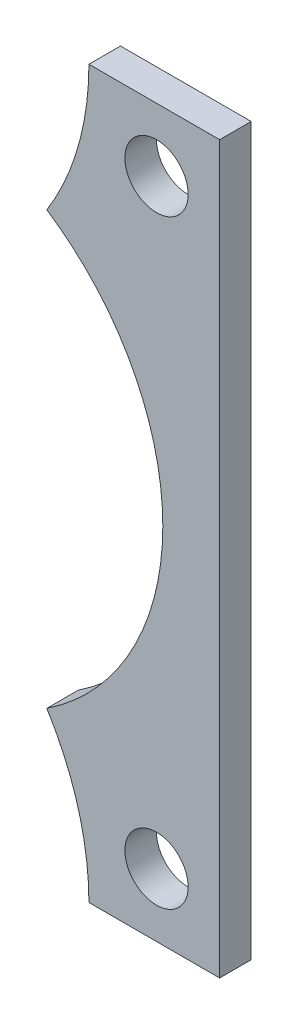
ISO-10303-21;
HEADER;
FILE_DESCRIPTION(('STEP AP214'),'2;1');
FILE_NAME('part.step','',(''),(''),'','','');
FILE_SCHEMA(('AUTOMOTIVE_DESIGN { 1 0 10303 214 1 1 1 1 }'));
ENDSEC;
DATA;
#1=APPLICATION_CONTEXT('core data for automotive mechanical design processes');
#2=APPLICATION_PROTOCOL_DEFINITION('international standard','automotive_design',2000,#1);
#3=PRODUCT_CONTEXT('',#1,'mechanical');
#4=PRODUCT('Part','Part','',(#3));
#5=PRODUCT_RELATED_PRODUCT_CATEGORY('part','',(#4));
#6=PRODUCT_DEFINITION_FORMATION('','',#4);
#7=PRODUCT_DEFINITION_CONTEXT('part definition',#1,'design');
#8=PRODUCT_DEFINITION('design','',#6,#7);
#9=PRODUCT_DEFINITION_SHAPE('','',#8);
#10=(LENGTH_UNIT() NAMED_UNIT(*) SI_UNIT(.MILLI.,.METRE.));
#11=(NAMED_UNIT(*) PLANE_ANGLE_UNIT() SI_UNIT($,.RADIAN.));
#12=(NAMED_UNIT(*) SI_UNIT($,.STERADIAN.) SOLID_ANGLE_UNIT());
#13=UNCERTAINTY_MEASURE_WITH_UNIT(LENGTH_MEASURE(1.E-05),#10,'distance_accuracy_value','');
#14=(GEOMETRIC_REPRESENTATION_CONTEXT(3) GLOBAL_UNCERTAINTY_ASSIGNED_CONTEXT((#13)) GLOBAL_UNIT_ASSIGNED_CONTEXT((#10,
#11,#12)) REPRESENTATION_CONTEXT('',''));
#15=CARTESIAN_POINT('',(0.,0.,0.));
#16=DIRECTION('',(0.,0.,1.));
#17=DIRECTION('',(1.,0.,0.));
#18=AXIS2_PLACEMENT_3D('',#15,#16,#17);
#19=CARTESIAN_POINT('',(-63.1804076074481,-73.025,3.175));
#20=DIRECTION('',(0.,0.,-1.));
#21=DIRECTION('',(-1.,0.,0.));
#22=AXIS2_PLACEMENT_3D('',#19,#20,#21);
#23=CYLINDRICAL_SURFACE('',#22,55.9342935428807);
#24=CARTESIAN_POINT('',(-63.1804076074481,-73.025,-3.175));
#25=DIRECTION('',(0.,0.,1.));
#26=DIRECTION('',(1.,0.,0.));
#27=AXIS2_PLACEMENT_3D('',#24,#25,#26);
#28=CIRCLE('',#27,55.9342935428807);
#29=CARTESIAN_POINT('',(-7.24611406456736,-73.025,-3.175));
#30=VERTEX_POINT('',#29);
#31=CARTESIAN_POINT('',(-15.7193193483994,-43.4261774658528,-3.175));
#32=VERTEX_POINT('',#31);
#33=EDGE_CURVE('E126',#30,#32,#28,.T.);
#34=ORIENTED_EDGE('',*,*,#33,.F.);
#35=DIRECTION('',(0.,0.,-1.));
#36=VECTOR('',#35,1.);
#37=CARTESIAN_POINT('',(-7.24611406456736,-73.025,3.175));
#38=LINE('',#37,#36);
#39=CARTESIAN_POINT('',(-7.24611406456736,-73.025,3.175));
#40=VERTEX_POINT('',#39);
#41=EDGE_CURVE('E11',#40,#30,#38,.T.);
#42=ORIENTED_EDGE('',*,*,#41,.F.);
#43=CARTESIAN_POINT('',(-63.1804076074481,-73.025,3.175));
#44=DIRECTION('',(0.,0.,1.));
#45=DIRECTION('',(1.,0.,0.));
#46=AXIS2_PLACEMENT_3D('',#43,#44,#45);
#47=CIRCLE('',#46,55.9342935428807);
#48=CARTESIAN_POINT('',(-15.7193193483994,-43.4261774658528,3.175));
#49=VERTEX_POINT('',#48);
#50=EDGE_CURVE('E145',#40,#49,#47,.T.);
#51=ORIENTED_EDGE('',*,*,#50,.T.);
#52=DIRECTION('',(0.,0.,-1.));
#53=VECTOR('',#52,1.);
#54=CARTESIAN_POINT('',(-15.7193193483994,-43.4261774658528,3.175));
#55=LINE('',#54,#53);
#56=EDGE_CURVE('E52',#49,#32,#55,.T.);
#57=ORIENTED_EDGE('',*,*,#56,.T.);
#58=EDGE_LOOP('',(#34,#42,#51,#57));
#59=FACE_BOUND('',#58,.T.);
#60=ADVANCED_FACE('F36',(#59),#23,.F.);
#61=CARTESIAN_POINT('',(0.,-73.025,3.175));
#62=DIRECTION('',(0.,1.,0.));
#63=DIRECTION('',(0.,0.,1.));
#64=AXIS2_PLACEMENT_3D('',#61,#62,#63);
#65=PLANE('',#64);
#66=DIRECTION('',(1.,0.,0.));
#67=VECTOR('',#66,1.);
#68=CARTESIAN_POINT('',(0.,-73.025,-3.175));
#69=LINE('',#68,#67);
#70=CARTESIAN_POINT('',(19.05,-73.025,-3.175));
#71=VERTEX_POINT('',#70);
#72=EDGE_CURVE('E128',#30,#71,#69,.T.);
#73=ORIENTED_EDGE('',*,*,#72,.T.);
#74=DIRECTION('',(0.,0.,-1.));
#75=VECTOR('',#74,1.);
#76=CARTESIAN_POINT('',(19.05,-73.025,3.175));
#77=LINE('',#76,#75);
#78=CARTESIAN_POINT('',(19.05,-73.025,3.175));
#79=VERTEX_POINT('',#78);
#80=EDGE_CURVE('E44',#79,#71,#77,.T.);
#81=ORIENTED_EDGE('',*,*,#80,.F.);
#82=DIRECTION('',(1.,0.,0.));
#83=VECTOR('',#82,1.);
#84=CARTESIAN_POINT('',(0.,-73.025,3.175));
#85=LINE('',#84,#83);
#86=EDGE_CURVE('E115',#40,#79,#85,.T.);
#87=ORIENTED_EDGE('',*,*,#86,.F.);
#88=ORIENTED_EDGE('',*,*,#41,.T.);
#89=EDGE_LOOP('',(#73,#81,#87,#88));
#90=FACE_BOUND('',#89,.T.);
#91=ADVANCED_FACE('F173',(#90),#65,.F.);
#92=CARTESIAN_POINT('',(19.05,0.,3.175));
#93=DIRECTION('',(-1.,0.,0.));
#94=DIRECTION('',(0.,0.,1.));
#95=AXIS2_PLACEMENT_3D('',#92,#93,#94);
#96=PLANE('',#95);
#97=DIRECTION('',(0.,1.,0.));
#98=VECTOR('',#97,1.);
#99=CARTESIAN_POINT('',(19.05,0.,-3.175));
#100=LINE('',#99,#98);
#101=CARTESIAN_POINT('',(19.05,73.025,-3.175));
#102=VERTEX_POINT('',#101);
#103=EDGE_CURVE('E130',#71,#102,#100,.T.);
#104=ORIENTED_EDGE('',*,*,#103,.T.);
#105=DIRECTION('',(0.,0.,-1.));
#106=VECTOR('',#105,1.);
#107=CARTESIAN_POINT('',(19.05,73.025,3.175));
#108=LINE('',#107,#106);
#109=CARTESIAN_POINT('',(19.05,73.025,3.175));
#110=VERTEX_POINT('',#109);
#111=EDGE_CURVE('E100',#110,#102,#108,.T.);
#112=ORIENTED_EDGE('',*,*,#111,.F.);
#113=DIRECTION('',(0.,1.,0.));
#114=VECTOR('',#113,1.);
#115=CARTESIAN_POINT('',(19.05,0.,3.175));
#116=LINE('',#115,#114);
#117=EDGE_CURVE('E112',#79,#110,#116,.T.);
#118=ORIENTED_EDGE('',*,*,#117,.F.);
#119=ORIENTED_EDGE('',*,*,#80,.T.);
#120=EDGE_LOOP('',(#104,#112,#118,#119));
#121=FACE_BOUND('',#120,.T.);
#122=ADVANCED_FACE('F152',(#121),#96,.F.);
#123=CARTESIAN_POINT('',(0.,73.025,3.175));
#124=DIRECTION('',(0.,1.,0.));
#125=DIRECTION('',(0.,0.,1.));
#126=AXIS2_PLACEMENT_3D('',#123,#124,#125);
#127=PLANE('',#126);
#128=DIRECTION('',(1.,0.,0.));
#129=VECTOR('',#128,1.);
#130=CARTESIAN_POINT('',(0.,73.025,-3.175));
#131=LINE('',#130,#129);
#132=CARTESIAN_POINT('',(-7.24611406456736,73.025,-3.175));
#133=VERTEX_POINT('',#132);
#134=EDGE_CURVE('E97',#133,#102,#131,.T.);
#135=ORIENTED_EDGE('',*,*,#134,.F.);
#136=DIRECTION('',(0.,0.,-1.));
#137=VECTOR('',#136,1.);
#138=CARTESIAN_POINT('',(-7.24611406456736,73.025,3.175));
#139=LINE('',#138,#137);
#140=CARTESIAN_POINT('',(-7.24611406456736,73.025,3.175));
#141=VERTEX_POINT('',#140);
#142=EDGE_CURVE('E91',#141,#133,#139,.T.);
#143=ORIENTED_EDGE('',*,*,#142,.F.);
#144=DIRECTION('',(1.,0.,0.));
#145=VECTOR('',#144,1.);
#146=CARTESIAN_POINT('',(0.,73.025,3.175));
#147=LINE('',#146,#145);
#148=EDGE_CURVE('E95',#141,#110,#147,.T.);
#149=ORIENTED_EDGE('',*,*,#148,.T.);
#150=ORIENTED_EDGE('',*,*,#111,.T.);
#151=EDGE_LOOP('',(#135,#143,#149,#150));
#152=FACE_BOUND('',#151,.T.);
#153=ADVANCED_FACE('F93',(#152),#127,.T.);
#154=CARTESIAN_POINT('',(-63.1804076074481,73.025,3.175));
#155=DIRECTION('',(0.,0.,-1.));
#156=DIRECTION('',(-1.,0.,0.));
#157=AXIS2_PLACEMENT_3D('',#154,#155,#156);
#158=CYLINDRICAL_SURFACE('',#157,55.9342935428807);
#159=CARTESIAN_POINT('',(-63.1804076074481,73.025,-3.175));
#160=DIRECTION('',(0.,0.,1.));
#161=DIRECTION('',(1.,0.,0.));
#162=AXIS2_PLACEMENT_3D('',#159,#160,#161);
#163=CIRCLE('',#162,55.9342935428807);
#164=CARTESIAN_POINT('',(-15.7193193483994,43.4261774658528,-3.175));
#165=VERTEX_POINT('',#164);
#166=EDGE_CURVE('E134',#133,#165,#163,.F.);
#167=ORIENTED_EDGE('',*,*,#166,.T.);
#168=DIRECTION('',(0.,0.,-1.));
#169=VECTOR('',#168,1.);
#170=CARTESIAN_POINT('',(-15.7193193483994,43.4261774658528,3.175));
#171=LINE('',#170,#169);
#172=CARTESIAN_POINT('',(-15.7193193483994,43.4261774658528,3.175));
#173=VERTEX_POINT('',#172);
#174=EDGE_CURVE('E72',#173,#165,#171,.T.);
#175=ORIENTED_EDGE('',*,*,#174,.F.);
#176=CARTESIAN_POINT('',(-63.1804076074481,73.025,3.175));
#177=DIRECTION('',(0.,0.,1.));
#178=DIRECTION('',(1.,0.,0.));
#179=AXIS2_PLACEMENT_3D('',#176,#177,#178);
#180=CIRCLE('',#179,55.9342935428807);
#181=EDGE_CURVE('E102',#141,#173,#180,.F.);
#182=ORIENTED_EDGE('',*,*,#181,.F.);
#183=ORIENTED_EDGE('',*,*,#142,.T.);
#184=EDGE_LOOP('',(#167,#175,#182,#183));
#185=FACE_BOUND('',#184,.T.);
#186=ADVANCED_FACE('F103',(#185),#158,.F.);
#187=CARTESIAN_POINT('',(6.35,-60.325,3.175));
#188=DIRECTION('',(0.,0.,-1.));
#189=DIRECTION('',(-1.,0.,0.));
#190=AXIS2_PLACEMENT_3D('',#187,#188,#189);
#191=CYLINDRICAL_SURFACE('',#190,6.3627);
#192=CARTESIAN_POINT('',(6.35,-60.325,3.175));
#193=DIRECTION('',(0.,0.,1.));
#194=DIRECTION('',(1.,0.,0.));
#195=AXIS2_PLACEMENT_3D('',#192,#193,#194);
#196=CIRCLE('',#195,6.3627);
#197=CARTESIAN_POINT('',(12.7127,-60.325,3.175));
#198=VERTEX_POINT('',#197);
#199=EDGE_CURVE('E120',#198,#198,#196,.T.);
#200=ORIENTED_EDGE('',*,*,#199,.T.);
#201=EDGE_LOOP('',(#200));
#202=FACE_BOUND('',#201,.T.);
#203=CARTESIAN_POINT('',(6.35,-60.325,-3.175));
#204=DIRECTION('',(0.,0.,1.));
#205=DIRECTION('',(1.,0.,0.));
#206=AXIS2_PLACEMENT_3D('',#203,#204,#205);
#207=CIRCLE('',#206,6.3627);
#208=CARTESIAN_POINT('',(12.7127,-60.325,-3.175));
#209=VERTEX_POINT('',#208);
#210=EDGE_CURVE('E139',#209,#209,#207,.T.);
#211=ORIENTED_EDGE('',*,*,#210,.F.);
#212=EDGE_LOOP('',(#211));
#213=FACE_BOUND('',#212,.T.);
#214=ADVANCED_FACE('F161',(#202,#213),#191,.F.);
#215=CARTESIAN_POINT('',(-44.45,0.,3.175));
#216=DIRECTION('',(0.,0.,-1.));
#217=DIRECTION('',(-1.,0.,0.));
#218=AXIS2_PLACEMENT_3D('',#215,#216,#217);
#219=CYLINDRICAL_SURFACE('',#218,52.07);
#220=CARTESIAN_POINT('',(-44.45,0.,-3.175));
#221=DIRECTION('',(0.,0.,1.));
#222=DIRECTION('',(1.,0.,0.));
#223=AXIS2_PLACEMENT_3D('',#220,#221,#222);
#224=CIRCLE('',#223,52.07);
#225=EDGE_CURVE('E136',#32,#165,#224,.T.);
#226=ORIENTED_EDGE('',*,*,#225,.F.);
#227=ORIENTED_EDGE('',*,*,#56,.F.);
#228=CARTESIAN_POINT('',(-44.45,0.,3.175));
#229=DIRECTION('',(0.,0.,1.));
#230=DIRECTION('',(1.,0.,0.));
#231=AXIS2_PLACEMENT_3D('',#228,#229,#230);
#232=CIRCLE('',#231,52.07);
#233=EDGE_CURVE('E106',#49,#173,#232,.T.);
#234=ORIENTED_EDGE('',*,*,#233,.T.);
#235=ORIENTED_EDGE('',*,*,#174,.T.);
#236=EDGE_LOOP('',(#226,#227,#234,#235));
#237=FACE_BOUND('',#236,.T.);
#238=ADVANCED_FACE('F158',(#237),#219,.F.);
#239=CARTESIAN_POINT('',(6.35,60.325,3.175));
#240=DIRECTION('',(0.,0.,-1.));
#241=DIRECTION('',(-1.,0.,0.));
#242=AXIS2_PLACEMENT_3D('',#239,#240,#241);
#243=CYLINDRICAL_SURFACE('',#242,6.3627);
#244=CARTESIAN_POINT('',(6.35,60.325,3.175));
#245=DIRECTION('',(0.,0.,1.));
#246=DIRECTION('',(1.,0.,0.));
#247=AXIS2_PLACEMENT_3D('',#244,#245,#246);
#248=CIRCLE('',#247,6.3627);
#249=CARTESIAN_POINT('',(12.7127,60.325,3.175));
#250=VERTEX_POINT('',#249);
#251=EDGE_CURVE('E123',#250,#250,#248,.T.);
#252=ORIENTED_EDGE('',*,*,#251,.T.);
#253=EDGE_LOOP('',(#252));
#254=FACE_BOUND('',#253,.T.);
#255=CARTESIAN_POINT('',(6.35,60.325,-3.175));
#256=DIRECTION('',(0.,0.,1.));
#257=DIRECTION('',(1.,0.,0.));
#258=AXIS2_PLACEMENT_3D('',#255,#256,#257);
#259=CIRCLE('',#258,6.3627);
#260=CARTESIAN_POINT('',(12.7127,60.325,-3.175));
#261=VERTEX_POINT('',#260);
#262=EDGE_CURVE('E142',#261,#261,#259,.T.);
#263=ORIENTED_EDGE('',*,*,#262,.F.);
#264=EDGE_LOOP('',(#263));
#265=FACE_BOUND('',#264,.T.);
#266=ADVANCED_FACE('F160',(#254,#265),#243,.F.);
#267=CARTESIAN_POINT('',(0.,0.,3.175));
#268=DIRECTION('',(0.,0.,1.));
#269=DIRECTION('',(1.,0.,0.));
#270=AXIS2_PLACEMENT_3D('',#267,#268,#269);
#271=PLANE('',#270);
#272=ORIENTED_EDGE('',*,*,#50,.F.);
#273=ORIENTED_EDGE('',*,*,#86,.T.);
#274=ORIENTED_EDGE('',*,*,#117,.T.);
#275=ORIENTED_EDGE('',*,*,#148,.F.);
#276=ORIENTED_EDGE('',*,*,#181,.T.);
#277=ORIENTED_EDGE('',*,*,#233,.F.);
#278=EDGE_LOOP('',(#272,#273,#274,#275,#276,#277));
#279=FACE_BOUND('',#278,.T.);
#280=ORIENTED_EDGE('',*,*,#199,.F.);
#281=EDGE_LOOP('',(#280));
#282=FACE_BOUND('',#281,.T.);
#283=ORIENTED_EDGE('',*,*,#251,.F.);
#284=EDGE_LOOP('',(#283));
#285=FACE_BOUND('',#284,.T.);
#286=ADVANCED_FACE('F109',(#279,#282,#285),#271,.T.);
#287=CARTESIAN_POINT('',(0.,0.,-3.175));
#288=DIRECTION('',(0.,0.,1.));
#289=DIRECTION('',(1.,0.,0.));
#290=AXIS2_PLACEMENT_3D('',#287,#288,#289);
#291=PLANE('',#290);
#292=ORIENTED_EDGE('',*,*,#33,.T.);
#293=ORIENTED_EDGE('',*,*,#225,.T.);
#294=ORIENTED_EDGE('',*,*,#166,.F.);
#295=ORIENTED_EDGE('',*,*,#134,.T.);
#296=ORIENTED_EDGE('',*,*,#103,.F.);
#297=ORIENTED_EDGE('',*,*,#72,.F.);
#298=EDGE_LOOP('',(#292,#293,#294,#295,#296,#297));
#299=FACE_BOUND('',#298,.T.);
#300=ORIENTED_EDGE('',*,*,#210,.T.);
#301=EDGE_LOOP('',(#300));
#302=FACE_BOUND('',#301,.T.);
#303=ORIENTED_EDGE('',*,*,#262,.T.);
#304=EDGE_LOOP('',(#303));
#305=FACE_BOUND('',#304,.T.);
#306=ADVANCED_FACE('F156',(#299,#302,#305),#291,.F.);
#307=CLOSED_SHELL('',(#60,#91,#122,#153,#186,#214,#238,#266,#286,#306));
#308=MANIFOLD_SOLID_BREP('B2',#307);
#309=ADVANCED_BREP_SHAPE_REPRESENTATION('',(#18,#308),#14);
#310=SHAPE_DEFINITION_REPRESENTATION(#9,#309);
ENDSEC;
END-ISO-10303-21;
